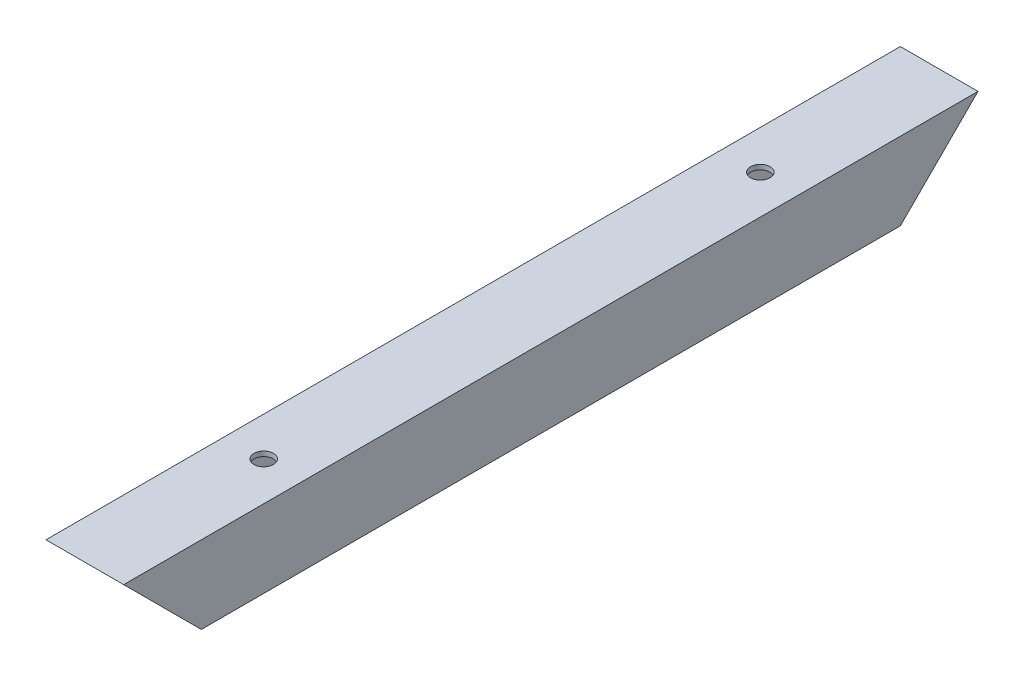
ISO-10303-21;
HEADER;
FILE_DESCRIPTION(('STEP AP214'),'2;1');
FILE_NAME('part.step','',(''),(''),'','','');
FILE_SCHEMA(('AUTOMOTIVE_DESIGN { 1 0 10303 214 1 1 1 1 }'));
ENDSEC;
DATA;
#1=APPLICATION_CONTEXT('core data for automotive mechanical design processes');
#2=APPLICATION_PROTOCOL_DEFINITION('international standard','automotive_design',2000,#1);
#3=PRODUCT_CONTEXT('',#1,'mechanical');
#4=PRODUCT('Part','Part','',(#3));
#5=PRODUCT_RELATED_PRODUCT_CATEGORY('part','',(#4));
#6=PRODUCT_DEFINITION_FORMATION('','',#4);
#7=PRODUCT_DEFINITION_CONTEXT('part definition',#1,'design');
#8=PRODUCT_DEFINITION('design','',#6,#7);
#9=PRODUCT_DEFINITION_SHAPE('','',#8);
#10=(LENGTH_UNIT() NAMED_UNIT(*) SI_UNIT(.MILLI.,.METRE.));
#11=(NAMED_UNIT(*) PLANE_ANGLE_UNIT() SI_UNIT($,.RADIAN.));
#12=(NAMED_UNIT(*) SI_UNIT($,.STERADIAN.) SOLID_ANGLE_UNIT());
#13=UNCERTAINTY_MEASURE_WITH_UNIT(LENGTH_MEASURE(1.E-05),#10,'distance_accuracy_value','');
#14=(GEOMETRIC_REPRESENTATION_CONTEXT(3) GLOBAL_UNCERTAINTY_ASSIGNED_CONTEXT((#13)) GLOBAL_UNIT_ASSIGNED_CONTEXT((#10,
#11,#12)) REPRESENTATION_CONTEXT('',''));
#15=CARTESIAN_POINT('',(0.,0.,0.));
#16=DIRECTION('',(0.,0.,1.));
#17=DIRECTION('',(1.,0.,0.));
#18=AXIS2_PLACEMENT_3D('',#15,#16,#17);
#19=CARTESIAN_POINT('',(488.95,1117.6,370.999999999996));
#20=DIRECTION('',(1.,0.,0.));
#21=DIRECTION('',(0.,0.,-1.));
#22=AXIS2_PLACEMENT_3D('',#19,#20,#21);
#23=PLANE('',#22);
#24=DIRECTION('',(0.,0.,-1.));
#25=VECTOR('',#24,1.);
#26=CARTESIAN_POINT('',(488.95,1066.8,370.999999999996));
#27=LINE('',#26,#25);
#28=CARTESIAN_POINT('',(488.95,1066.8,320.199999999997));
#29=VERTEX_POINT('',#28);
#30=CARTESIAN_POINT('',(488.95,1066.8,-137.000000000005));
#31=VERTEX_POINT('',#30);
#32=EDGE_CURVE('E71',#29,#31,#27,.T.);
#33=ORIENTED_EDGE('',*,*,#32,.F.);
#34=DIRECTION('',(0.,0.707106781186548,0.707106781186548));
#35=VECTOR('',#34,1.);
#36=CARTESIAN_POINT('',(488.95,1117.6,370.999999999996));
#37=LINE('',#36,#35);
#38=CARTESIAN_POINT('',(488.95,1117.6,370.999999999996));
#39=VERTEX_POINT('',#38);
#40=EDGE_CURVE('E149',#29,#39,#37,.T.);
#41=ORIENTED_EDGE('',*,*,#40,.T.);
#42=DIRECTION('',(0.,0.,-1.));
#43=VECTOR('',#42,1.);
#44=CARTESIAN_POINT('',(488.95,1117.6,370.999999999996));
#45=LINE('',#44,#43);
#46=CARTESIAN_POINT('',(488.95,1117.6,-187.800000000004));
#47=VERTEX_POINT('',#46);
#48=EDGE_CURVE('E144',#39,#47,#45,.T.);
#49=ORIENTED_EDGE('',*,*,#48,.T.);
#50=DIRECTION('',(0.,0.707106781186548,-0.707106781186548));
#51=VECTOR('',#50,1.);
#52=CARTESIAN_POINT('',(488.95,1117.6,-187.800000000004));
#53=LINE('',#52,#51);
#54=EDGE_CURVE('E147',#31,#47,#53,.T.);
#55=ORIENTED_EDGE('',*,*,#54,.F.);
#56=EDGE_LOOP('',(#33,#41,#49,#55));
#57=FACE_BOUND('',#56,.T.);
#58=ADVANCED_FACE('F62',(#57),#23,.F.);
#59=CARTESIAN_POINT('',(488.95,1066.8,370.999999999996));
#60=DIRECTION('',(0.,1.,0.));
#61=DIRECTION('',(0.,0.,1.));
#62=AXIS2_PLACEMENT_3D('',#59,#60,#61);
#63=PLANE('',#62);
#64=CARTESIAN_POINT('',(514.35,1066.8,254.));
#65=DIRECTION('',(0.,1.,0.));
#66=DIRECTION('',(0.,0.,1.));
#67=AXIS2_PLACEMENT_3D('',#64,#65,#66);
#68=CIRCLE('',#67,6.34999999999994);
#69=CARTESIAN_POINT('',(514.35,1066.8,260.35));
#70=VERTEX_POINT('',#69);
#71=EDGE_CURVE('E191',#70,#70,#68,.T.);
#72=ORIENTED_EDGE('',*,*,#71,.T.);
#73=EDGE_LOOP('',(#72));
#74=FACE_BOUND('',#73,.T.);
#75=DIRECTION('',(0.,0.,-1.));
#76=VECTOR('',#75,1.);
#77=CARTESIAN_POINT('',(539.75,1066.8,370.999999999996));
#78=LINE('',#77,#76);
#79=CARTESIAN_POINT('',(539.75,1066.8,320.199999999997));
#80=VERTEX_POINT('',#79);
#81=CARTESIAN_POINT('',(539.75,1066.8,-137.000000000005));
#82=VERTEX_POINT('',#81);
#83=EDGE_CURVE('E236',#80,#82,#78,.T.);
#84=ORIENTED_EDGE('',*,*,#83,.F.);
#85=DIRECTION('',(-1.,0.,0.));
#86=VECTOR('',#85,1.);
#87=CARTESIAN_POINT('',(963.860679958317,1066.8,320.199999999997));
#88=LINE('',#87,#86);
#89=EDGE_CURVE('E81',#80,#29,#88,.T.);
#90=ORIENTED_EDGE('',*,*,#89,.T.);
#91=ORIENTED_EDGE('',*,*,#32,.T.);
#92=DIRECTION('',(-1.,0.,0.));
#93=VECTOR('',#92,1.);
#94=CARTESIAN_POINT('',(963.860679958317,1066.8,-137.000000000005));
#95=LINE('',#94,#93);
#96=EDGE_CURVE('E170',#82,#31,#95,.T.);
#97=ORIENTED_EDGE('',*,*,#96,.F.);
#98=EDGE_LOOP('',(#84,#90,#91,#97));
#99=FACE_BOUND('',#98,.T.);
#100=CARTESIAN_POINT('',(514.35,1066.8,-70.800000000008));
#101=DIRECTION('',(0.,-1.,0.));
#102=DIRECTION('',(0.,0.,-1.));
#103=AXIS2_PLACEMENT_3D('',#100,#101,#102);
#104=CIRCLE('',#103,6.34999999999994);
#105=CARTESIAN_POINT('',(514.35,1066.8,-77.1500000000079));
#106=VERTEX_POINT('',#105);
#107=EDGE_CURVE('E190',#106,#106,#104,.T.);
#108=ORIENTED_EDGE('',*,*,#107,.F.);
#109=EDGE_LOOP('',(#108));
#110=FACE_BOUND('',#109,.T.);
#111=ADVANCED_FACE('F240',(#74,#99,#110),#63,.F.);
#112=CARTESIAN_POINT('',(539.75,1117.6,370.999999999996));
#113=DIRECTION('',(-1.,0.,0.));
#114=DIRECTION('',(0.,0.,1.));
#115=AXIS2_PLACEMENT_3D('',#112,#113,#114);
#116=PLANE('',#115);
#117=DIRECTION('',(0.,0.,-1.));
#118=VECTOR('',#117,1.);
#119=CARTESIAN_POINT('',(539.75,1117.6,370.999999999996));
#120=LINE('',#119,#118);
#121=CARTESIAN_POINT('',(539.75,1117.6,370.999999999996));
#122=VERTEX_POINT('',#121);
#123=CARTESIAN_POINT('',(539.75,1117.6,-187.800000000004));
#124=VERTEX_POINT('',#123);
#125=EDGE_CURVE('E154',#122,#124,#120,.T.);
#126=ORIENTED_EDGE('',*,*,#125,.F.);
#127=DIRECTION('',(0.,-0.707106781186548,-0.707106781186548));
#128=VECTOR('',#127,1.);
#129=CARTESIAN_POINT('',(539.75,1117.6,370.999999999996));
#130=LINE('',#129,#128);
#131=EDGE_CURVE('E91',#122,#80,#130,.T.);
#132=ORIENTED_EDGE('',*,*,#131,.T.);
#133=ORIENTED_EDGE('',*,*,#83,.T.);
#134=DIRECTION('',(0.,-0.707106781186548,0.707106781186548));
#135=VECTOR('',#134,1.);
#136=CARTESIAN_POINT('',(539.75,1117.6,-187.800000000004));
#137=LINE('',#136,#135);
#138=EDGE_CURVE('E172',#124,#82,#137,.T.);
#139=ORIENTED_EDGE('',*,*,#138,.F.);
#140=EDGE_LOOP('',(#126,#132,#133,#139));
#141=FACE_BOUND('',#140,.T.);
#142=ADVANCED_FACE('F263',(#141),#116,.F.);
#143=CARTESIAN_POINT('',(488.95,1117.6,370.999999999996));
#144=DIRECTION('',(0.,-1.,0.));
#145=DIRECTION('',(0.,0.,-1.));
#146=AXIS2_PLACEMENT_3D('',#143,#144,#145);
#147=PLANE('',#146);
#148=CARTESIAN_POINT('',(514.35,1117.6,254.));
#149=DIRECTION('',(0.,1.,0.));
#150=DIRECTION('',(0.,0.,1.));
#151=AXIS2_PLACEMENT_3D('',#148,#149,#150);
#152=CIRCLE('',#151,6.34999999999994);
#153=CARTESIAN_POINT('',(514.35,1117.6,260.35));
#154=VERTEX_POINT('',#153);
#155=EDGE_CURVE('E184',#154,#154,#152,.T.);
#156=ORIENTED_EDGE('',*,*,#155,.F.);
#157=EDGE_LOOP('',(#156));
#158=FACE_BOUND('',#157,.T.);
#159=ORIENTED_EDGE('',*,*,#125,.T.);
#160=DIRECTION('',(-1.,0.,0.));
#161=VECTOR('',#160,1.);
#162=CARTESIAN_POINT('',(488.95,1117.6,-187.800000000004));
#163=LINE('',#162,#161);
#164=EDGE_CURVE('E158',#124,#47,#163,.T.);
#165=ORIENTED_EDGE('',*,*,#164,.T.);
#166=ORIENTED_EDGE('',*,*,#48,.F.);
#167=DIRECTION('',(-1.,0.,0.));
#168=VECTOR('',#167,1.);
#169=CARTESIAN_POINT('',(488.95,1117.6,370.999999999996));
#170=LINE('',#169,#168);
#171=EDGE_CURVE('E155',#122,#39,#170,.T.);
#172=ORIENTED_EDGE('',*,*,#171,.F.);
#173=EDGE_LOOP('',(#159,#165,#166,#172));
#174=FACE_BOUND('',#173,.T.);
#175=CARTESIAN_POINT('',(514.35,1117.6,-70.800000000008));
#176=DIRECTION('',(0.,-1.,0.));
#177=DIRECTION('',(0.,0.,-1.));
#178=AXIS2_PLACEMENT_3D('',#175,#176,#177);
#179=CIRCLE('',#178,6.34999999999994);
#180=CARTESIAN_POINT('',(514.35,1117.6,-77.1500000000079));
#181=VERTEX_POINT('',#180);
#182=EDGE_CURVE('E309',#181,#181,#179,.T.);
#183=ORIENTED_EDGE('',*,*,#182,.T.);
#184=EDGE_LOOP('',(#183));
#185=FACE_BOUND('',#184,.T.);
#186=ADVANCED_FACE('F159',(#158,#174,#185),#147,.F.);
#187=CARTESIAN_POINT('',(492.125,1117.6,370.999999999996));
#188=DIRECTION('',(1.,0.,0.));
#189=DIRECTION('',(0.,0.,-1.));
#190=AXIS2_PLACEMENT_3D('',#187,#188,#189);
#191=PLANE('',#190);
#192=DIRECTION('',(0.,0.707106781186548,0.707106781186548));
#193=VECTOR('',#192,1.);
#194=CARTESIAN_POINT('',(492.125,1117.6,370.999999999996));
#195=LINE('',#194,#193);
#196=CARTESIAN_POINT('',(492.125,1069.975,323.374999999997));
#197=VERTEX_POINT('',#196);
#198=CARTESIAN_POINT('',(492.125,1114.425,367.824999999996));
#199=VERTEX_POINT('',#198);
#200=EDGE_CURVE('E212',#197,#199,#195,.T.);
#201=ORIENTED_EDGE('',*,*,#200,.F.);
#202=DIRECTION('',(0.,0.,-1.));
#203=VECTOR('',#202,1.);
#204=CARTESIAN_POINT('',(492.125,1069.975,370.999999999996));
#205=LINE('',#204,#203);
#206=CARTESIAN_POINT('',(492.125,1069.975,-140.175000000005));
#207=VERTEX_POINT('',#206);
#208=EDGE_CURVE('E229',#197,#207,#205,.T.);
#209=ORIENTED_EDGE('',*,*,#208,.T.);
#210=DIRECTION('',(0.,0.707106781186548,-0.707106781186548));
#211=VECTOR('',#210,1.);
#212=CARTESIAN_POINT('',(492.125,1117.6,-187.800000000004));
#213=LINE('',#212,#211);
#214=CARTESIAN_POINT('',(492.125,1114.425,-184.625000000004));
#215=VERTEX_POINT('',#214);
#216=EDGE_CURVE('E177',#207,#215,#213,.T.);
#217=ORIENTED_EDGE('',*,*,#216,.T.);
#218=DIRECTION('',(0.,0.,-1.));
#219=VECTOR('',#218,1.);
#220=CARTESIAN_POINT('',(492.125,1114.425,370.999999999996));
#221=LINE('',#220,#219);
#222=EDGE_CURVE('E220',#199,#215,#221,.T.);
#223=ORIENTED_EDGE('',*,*,#222,.F.);
#224=EDGE_LOOP('',(#201,#209,#217,#223));
#225=FACE_BOUND('',#224,.T.);
#226=ADVANCED_FACE('F272',(#225),#191,.T.);
#227=CARTESIAN_POINT('',(488.95,1069.975,370.999999999996));
#228=DIRECTION('',(0.,1.,0.));
#229=DIRECTION('',(0.,0.,1.));
#230=AXIS2_PLACEMENT_3D('',#227,#228,#229);
#231=PLANE('',#230);
#232=CARTESIAN_POINT('',(514.35,1069.975,254.));
#233=DIRECTION('',(0.,1.,0.));
#234=DIRECTION('',(0.,0.,1.));
#235=AXIS2_PLACEMENT_3D('',#232,#233,#234);
#236=CIRCLE('',#235,6.34999999999994);
#237=CARTESIAN_POINT('',(514.35,1069.975,260.35));
#238=VERTEX_POINT('',#237);
#239=EDGE_CURVE('E198',#238,#238,#236,.T.);
#240=ORIENTED_EDGE('',*,*,#239,.F.);
#241=EDGE_LOOP('',(#240));
#242=FACE_BOUND('',#241,.T.);
#243=DIRECTION('',(-1.,0.,0.));
#244=VECTOR('',#243,1.);
#245=CARTESIAN_POINT('',(488.95,1069.975,323.374999999997));
#246=LINE('',#245,#244);
#247=CARTESIAN_POINT('',(536.575,1069.975,323.374999999997));
#248=VERTEX_POINT('',#247);
#249=EDGE_CURVE('E208',#248,#197,#246,.T.);
#250=ORIENTED_EDGE('',*,*,#249,.F.);
#251=DIRECTION('',(0.,0.,-1.));
#252=VECTOR('',#251,1.);
#253=CARTESIAN_POINT('',(536.575,1069.975,370.999999999996));
#254=LINE('',#253,#252);
#255=CARTESIAN_POINT('',(536.575,1069.975,-140.175000000005));
#256=VERTEX_POINT('',#255);
#257=EDGE_CURVE('E226',#248,#256,#254,.T.);
#258=ORIENTED_EDGE('',*,*,#257,.T.);
#259=DIRECTION('',(-1.,0.,0.));
#260=VECTOR('',#259,1.);
#261=CARTESIAN_POINT('',(488.95,1069.975,-140.175000000005));
#262=LINE('',#261,#260);
#263=EDGE_CURVE('E298',#256,#207,#262,.T.);
#264=ORIENTED_EDGE('',*,*,#263,.T.);
#265=ORIENTED_EDGE('',*,*,#208,.F.);
#266=EDGE_LOOP('',(#250,#258,#264,#265));
#267=FACE_BOUND('',#266,.T.);
#268=CARTESIAN_POINT('',(514.35,1069.975,-70.800000000008));
#269=DIRECTION('',(0.,-1.,0.));
#270=DIRECTION('',(0.,0.,-1.));
#271=AXIS2_PLACEMENT_3D('',#268,#269,#270);
#272=CIRCLE('',#271,6.34999999999994);
#273=CARTESIAN_POINT('',(514.35,1069.975,-77.1500000000079));
#274=VERTEX_POINT('',#273);
#275=EDGE_CURVE('E189',#274,#274,#272,.T.);
#276=ORIENTED_EDGE('',*,*,#275,.T.);
#277=EDGE_LOOP('',(#276));
#278=FACE_BOUND('',#277,.T.);
#279=ADVANCED_FACE('F276',(#242,#267,#278),#231,.T.);
#280=CARTESIAN_POINT('',(536.575,1117.6,370.999999999996));
#281=DIRECTION('',(-1.,0.,0.));
#282=DIRECTION('',(0.,0.,1.));
#283=AXIS2_PLACEMENT_3D('',#280,#281,#282);
#284=PLANE('',#283);
#285=DIRECTION('',(0.,-0.707106781186548,-0.707106781186548));
#286=VECTOR('',#285,1.);
#287=CARTESIAN_POINT('',(536.575,1117.6,370.999999999996));
#288=LINE('',#287,#286);
#289=CARTESIAN_POINT('',(536.575,1114.425,367.824999999996));
#290=VERTEX_POINT('',#289);
#291=EDGE_CURVE('E204',#290,#248,#288,.T.);
#292=ORIENTED_EDGE('',*,*,#291,.F.);
#293=DIRECTION('',(0.,0.,-1.));
#294=VECTOR('',#293,1.);
#295=CARTESIAN_POINT('',(536.575,1114.425,370.999999999996));
#296=LINE('',#295,#294);
#297=CARTESIAN_POINT('',(536.575,1114.425,-184.625000000004));
#298=VERTEX_POINT('',#297);
#299=EDGE_CURVE('E223',#290,#298,#296,.T.);
#300=ORIENTED_EDGE('',*,*,#299,.T.);
#301=DIRECTION('',(0.,-0.707106781186548,0.707106781186548));
#302=VECTOR('',#301,1.);
#303=CARTESIAN_POINT('',(536.575,1117.6,-187.800000000004));
#304=LINE('',#303,#302);
#305=EDGE_CURVE('E300',#298,#256,#304,.T.);
#306=ORIENTED_EDGE('',*,*,#305,.T.);
#307=ORIENTED_EDGE('',*,*,#257,.F.);
#308=EDGE_LOOP('',(#292,#300,#306,#307));
#309=FACE_BOUND('',#308,.T.);
#310=ADVANCED_FACE('F256',(#309),#284,.T.);
#311=CARTESIAN_POINT('',(488.95,1114.425,370.999999999996));
#312=DIRECTION('',(0.,-1.,0.));
#313=DIRECTION('',(0.,0.,-1.));
#314=AXIS2_PLACEMENT_3D('',#311,#312,#313);
#315=PLANE('',#314);
#316=CARTESIAN_POINT('',(514.35,1114.425,254.));
#317=DIRECTION('',(0.,-1.,0.));
#318=DIRECTION('',(0.,0.,-1.));
#319=AXIS2_PLACEMENT_3D('',#316,#317,#318);
#320=CIRCLE('',#319,6.34999999999994);
#321=CARTESIAN_POINT('',(514.35,1114.425,247.65));
#322=VERTEX_POINT('',#321);
#323=EDGE_CURVE('E65',#322,#322,#320,.T.);
#324=ORIENTED_EDGE('',*,*,#323,.F.);
#325=EDGE_LOOP('',(#324));
#326=FACE_BOUND('',#325,.T.);
#327=DIRECTION('',(1.,0.,0.));
#328=VECTOR('',#327,1.);
#329=CARTESIAN_POINT('',(488.95,1114.425,367.824999999996));
#330=LINE('',#329,#328);
#331=EDGE_CURVE('E12',#199,#290,#330,.T.);
#332=ORIENTED_EDGE('',*,*,#331,.F.);
#333=ORIENTED_EDGE('',*,*,#222,.T.);
#334=DIRECTION('',(1.,0.,0.));
#335=VECTOR('',#334,1.);
#336=CARTESIAN_POINT('',(488.95,1114.425,-184.625000000004));
#337=LINE('',#336,#335);
#338=EDGE_CURVE('E165',#215,#298,#337,.T.);
#339=ORIENTED_EDGE('',*,*,#338,.T.);
#340=ORIENTED_EDGE('',*,*,#299,.F.);
#341=EDGE_LOOP('',(#332,#333,#339,#340));
#342=FACE_BOUND('',#341,.T.);
#343=CARTESIAN_POINT('',(514.35,1114.425,-70.800000000008));
#344=DIRECTION('',(0.,1.,0.));
#345=DIRECTION('',(0.,0.,1.));
#346=AXIS2_PLACEMENT_3D('',#343,#344,#345);
#347=CIRCLE('',#346,6.34999999999994);
#348=CARTESIAN_POINT('',(514.35,1114.425,-64.450000000008));
#349=VERTEX_POINT('',#348);
#350=EDGE_CURVE('E185',#349,#349,#347,.T.);
#351=ORIENTED_EDGE('',*,*,#350,.T.);
#352=EDGE_LOOP('',(#351));
#353=FACE_BOUND('',#352,.T.);
#354=ADVANCED_FACE('F246',(#326,#342,#353),#315,.T.);
#355=CARTESIAN_POINT('',(963.860679958317,1117.6,370.999999999996));
#356=DIRECTION('',(0.,0.707106781186548,-0.707106781186548));
#357=DIRECTION('',(0.,0.707106781186548,0.707106781186548));
#358=AXIS2_PLACEMENT_3D('',#355,#356,#357);
#359=PLANE('',#358);
#360=ORIENTED_EDGE('',*,*,#249,.T.);
#361=ORIENTED_EDGE('',*,*,#200,.T.);
#362=ORIENTED_EDGE('',*,*,#331,.T.);
#363=ORIENTED_EDGE('',*,*,#291,.T.);
#364=EDGE_LOOP('',(#360,#361,#362,#363));
#365=FACE_BOUND('',#364,.T.);
#366=ORIENTED_EDGE('',*,*,#40,.F.);
#367=ORIENTED_EDGE('',*,*,#89,.F.);
#368=ORIENTED_EDGE('',*,*,#131,.F.);
#369=ORIENTED_EDGE('',*,*,#171,.T.);
#370=EDGE_LOOP('',(#366,#367,#368,#369));
#371=FACE_BOUND('',#370,.T.);
#372=ADVANCED_FACE('F243',(#365,#371),#359,.F.);
#373=CARTESIAN_POINT('',(514.35,1066.8,254.));
#374=DIRECTION('',(0.,1.,0.));
#375=DIRECTION('',(0.,0.,1.));
#376=AXIS2_PLACEMENT_3D('',#373,#374,#375);
#377=CYLINDRICAL_SURFACE('',#376,6.34999999999994);
#378=ORIENTED_EDGE('',*,*,#323,.T.);
#379=EDGE_LOOP('',(#378));
#380=FACE_BOUND('',#379,.T.);
#381=ORIENTED_EDGE('',*,*,#155,.T.);
#382=EDGE_LOOP('',(#381));
#383=FACE_BOUND('',#382,.T.);
#384=ADVANCED_FACE('F245',(#380,#383),#377,.F.);
#385=ORIENTED_EDGE('',*,*,#239,.T.);
#386=EDGE_LOOP('',(#385));
#387=FACE_BOUND('',#386,.T.);
#388=ORIENTED_EDGE('',*,*,#71,.F.);
#389=EDGE_LOOP('',(#388));
#390=FACE_BOUND('',#389,.T.);
#391=ADVANCED_FACE('F253',(#387,#390),#377,.F.);
#392=CARTESIAN_POINT('',(963.860679958317,1117.6,-187.800000000004));
#393=DIRECTION('',(0.,0.707106781186548,0.707106781186548));
#394=DIRECTION('',(0.,0.707106781186548,-0.707106781186548));
#395=AXIS2_PLACEMENT_3D('',#392,#393,#394);
#396=PLANE('',#395);
#397=ORIENTED_EDGE('',*,*,#263,.F.);
#398=ORIENTED_EDGE('',*,*,#305,.F.);
#399=ORIENTED_EDGE('',*,*,#338,.F.);
#400=ORIENTED_EDGE('',*,*,#216,.F.);
#401=EDGE_LOOP('',(#397,#398,#399,#400));
#402=FACE_BOUND('',#401,.T.);
#403=ORIENTED_EDGE('',*,*,#54,.T.);
#404=ORIENTED_EDGE('',*,*,#164,.F.);
#405=ORIENTED_EDGE('',*,*,#138,.T.);
#406=ORIENTED_EDGE('',*,*,#96,.T.);
#407=EDGE_LOOP('',(#403,#404,#405,#406));
#408=FACE_BOUND('',#407,.T.);
#409=ADVANCED_FACE('F168',(#402,#408),#396,.F.);
#410=CARTESIAN_POINT('',(514.35,1066.8,-70.800000000008));
#411=DIRECTION('',(0.,1.,0.));
#412=DIRECTION('',(0.,0.,-1.));
#413=AXIS2_PLACEMENT_3D('',#410,#411,#412);
#414=CYLINDRICAL_SURFACE('',#413,6.34999999999994);
#415=ORIENTED_EDGE('',*,*,#350,.F.);
#416=EDGE_LOOP('',(#415));
#417=FACE_BOUND('',#416,.T.);
#418=ORIENTED_EDGE('',*,*,#182,.F.);
#419=EDGE_LOOP('',(#418));
#420=FACE_BOUND('',#419,.T.);
#421=ADVANCED_FACE('F319',(#417,#420),#414,.F.);
#422=ORIENTED_EDGE('',*,*,#275,.F.);
#423=EDGE_LOOP('',(#422));
#424=FACE_BOUND('',#423,.T.);
#425=ORIENTED_EDGE('',*,*,#107,.T.);
#426=EDGE_LOOP('',(#425));
#427=FACE_BOUND('',#426,.T.);
#428=ADVANCED_FACE('F317',(#424,#427),#414,.F.);
#429=CLOSED_SHELL('',(#58,#111,#142,#186,#226,#279,#310,#354,#372,#384,#391,#409,#421,#428));
#430=MANIFOLD_SOLID_BREP('B2',#429);
#431=ADVANCED_BREP_SHAPE_REPRESENTATION('',(#18,#430),#14);
#432=SHAPE_DEFINITION_REPRESENTATION(#9,#431);
ENDSEC;
END-ISO-10303-21;
